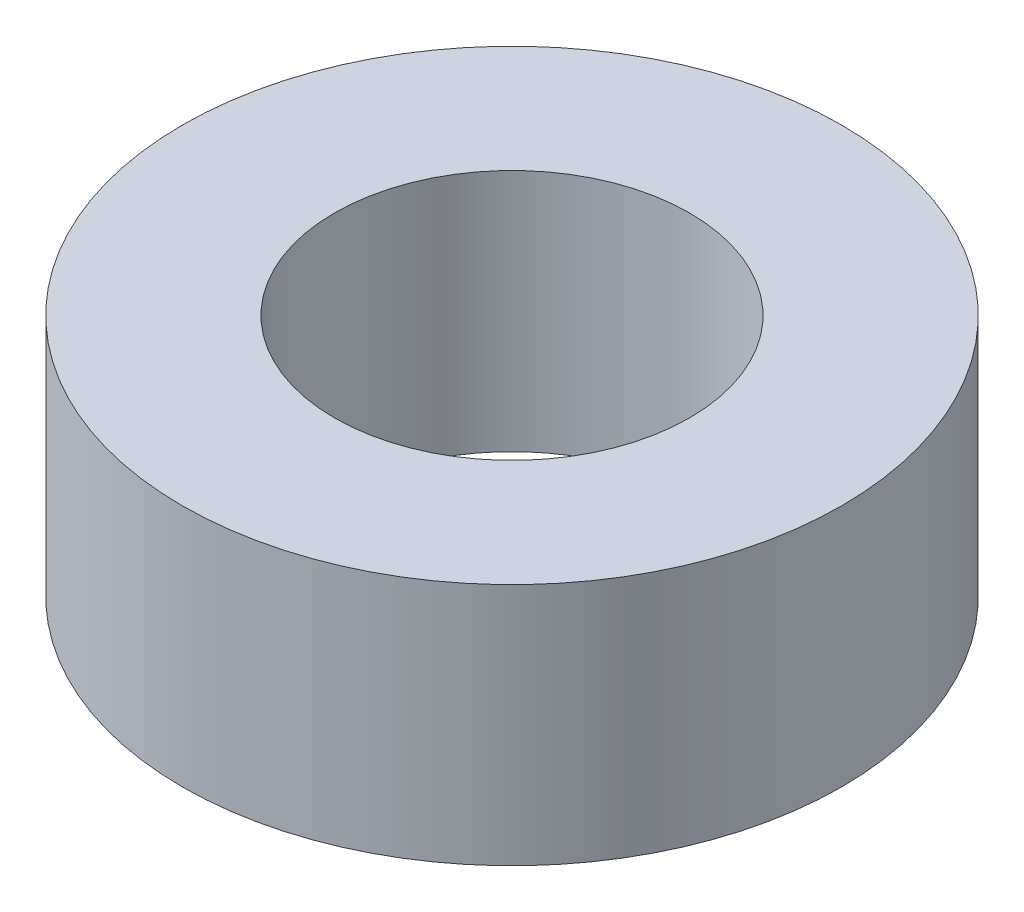
ISO-10303-21;
HEADER;
FILE_DESCRIPTION(('STEP AP214'),'2;1');
FILE_NAME('part.step','',(''),(''),'','','');
FILE_SCHEMA(('AUTOMOTIVE_DESIGN { 1 0 10303 214 1 1 1 1 }'));
ENDSEC;
DATA;
#1=APPLICATION_CONTEXT('core data for automotive mechanical design processes');
#2=APPLICATION_PROTOCOL_DEFINITION('international standard','automotive_design',2000,#1);
#3=PRODUCT_CONTEXT('',#1,'mechanical');
#4=PRODUCT('Part','Part','',(#3));
#5=PRODUCT_RELATED_PRODUCT_CATEGORY('part','',(#4));
#6=PRODUCT_DEFINITION_FORMATION('','',#4);
#7=PRODUCT_DEFINITION_CONTEXT('part definition',#1,'design');
#8=PRODUCT_DEFINITION('design','',#6,#7);
#9=PRODUCT_DEFINITION_SHAPE('','',#8);
#10=(LENGTH_UNIT() NAMED_UNIT(*) SI_UNIT(.MILLI.,.METRE.));
#11=(NAMED_UNIT(*) PLANE_ANGLE_UNIT() SI_UNIT($,.RADIAN.));
#12=(NAMED_UNIT(*) SI_UNIT($,.STERADIAN.) SOLID_ANGLE_UNIT());
#13=UNCERTAINTY_MEASURE_WITH_UNIT(LENGTH_MEASURE(1.E-05),#10,'distance_accuracy_value','');
#14=(GEOMETRIC_REPRESENTATION_CONTEXT(3) GLOBAL_UNCERTAINTY_ASSIGNED_CONTEXT((#13)) GLOBAL_UNIT_ASSIGNED_CONTEXT((#10,
#11,#12)) REPRESENTATION_CONTEXT('',''));
#15=CARTESIAN_POINT('',(0.,0.,0.));
#16=DIRECTION('',(0.,0.,1.));
#17=DIRECTION('',(1.,0.,0.));
#18=AXIS2_PLACEMENT_3D('',#15,#16,#17);
#19=CARTESIAN_POINT('',(0.,24.,0.));
#20=DIRECTION('',(0.,-1.,0.));
#21=DIRECTION('',(0.,0.,-1.));
#22=AXIS2_PLACEMENT_3D('',#19,#20,#21);
#23=CYLINDRICAL_SURFACE('',#22,32.5);
#24=CARTESIAN_POINT('',(0.,24.,0.));
#25=DIRECTION('',(0.,1.,0.));
#26=DIRECTION('',(0.,0.,1.));
#27=AXIS2_PLACEMENT_3D('',#24,#25,#26);
#28=CIRCLE('',#27,32.5);
#29=CARTESIAN_POINT('',(0.,24.,32.5));
#30=VERTEX_POINT('',#29);
#31=EDGE_CURVE('E10',#30,#30,#28,.T.);
#32=ORIENTED_EDGE('',*,*,#31,.F.);
#33=EDGE_LOOP('',(#32));
#34=FACE_BOUND('',#33,.T.);
#35=CARTESIAN_POINT('',(0.,0.,0.));
#36=DIRECTION('',(0.,1.,0.));
#37=DIRECTION('',(0.,0.,1.));
#38=AXIS2_PLACEMENT_3D('',#35,#36,#37);
#39=CIRCLE('',#38,32.5);
#40=CARTESIAN_POINT('',(0.,0.,32.5));
#41=VERTEX_POINT('',#40);
#42=EDGE_CURVE('E37',#41,#41,#39,.T.);
#43=ORIENTED_EDGE('',*,*,#42,.T.);
#44=EDGE_LOOP('',(#43));
#45=FACE_BOUND('',#44,.T.);
#46=ADVANCED_FACE('F40',(#34,#45),#23,.T.);
#47=CARTESIAN_POINT('',(0.,24.,0.));
#48=DIRECTION('',(0.,1.,0.));
#49=DIRECTION('',(0.,0.,1.));
#50=AXIS2_PLACEMENT_3D('',#47,#48,#49);
#51=PLANE('',#50);
#52=CARTESIAN_POINT('',(0.,24.,0.));
#53=DIRECTION('',(0.,1.,0.));
#54=DIRECTION('',(0.,0.,1.));
#55=AXIS2_PLACEMENT_3D('',#52,#53,#54);
#56=CIRCLE('',#55,17.5);
#57=CARTESIAN_POINT('',(0.,24.,17.5));
#58=VERTEX_POINT('',#57);
#59=EDGE_CURVE('E50',#58,#58,#56,.T.);
#60=ORIENTED_EDGE('',*,*,#59,.F.);
#61=EDGE_LOOP('',(#60));
#62=FACE_BOUND('',#61,.T.);
#63=ORIENTED_EDGE('',*,*,#31,.T.);
#64=EDGE_LOOP('',(#63));
#65=FACE_BOUND('',#64,.T.);
#66=ADVANCED_FACE('F59',(#62,#65),#51,.T.);
#67=CARTESIAN_POINT('',(0.,0.,0.));
#68=DIRECTION('',(0.,1.,0.));
#69=DIRECTION('',(0.,0.,1.));
#70=AXIS2_PLACEMENT_3D('',#67,#68,#69);
#71=PLANE('',#70);
#72=CARTESIAN_POINT('',(0.,0.,0.));
#73=DIRECTION('',(0.,1.,0.));
#74=DIRECTION('',(0.,0.,1.));
#75=AXIS2_PLACEMENT_3D('',#72,#73,#74);
#76=CIRCLE('',#75,17.5);
#77=CARTESIAN_POINT('',(0.,0.,17.5));
#78=VERTEX_POINT('',#77);
#79=EDGE_CURVE('E47',#78,#78,#76,.T.);
#80=ORIENTED_EDGE('',*,*,#79,.T.);
#81=EDGE_LOOP('',(#80));
#82=FACE_BOUND('',#81,.T.);
#83=ORIENTED_EDGE('',*,*,#42,.F.);
#84=EDGE_LOOP('',(#83));
#85=FACE_BOUND('',#84,.T.);
#86=ADVANCED_FACE('F58',(#82,#85),#71,.F.);
#87=CARTESIAN_POINT('',(0.,24.,0.));
#88=DIRECTION('',(0.,-1.,0.));
#89=DIRECTION('',(0.,0.,-1.));
#90=AXIS2_PLACEMENT_3D('',#87,#88,#89);
#91=CYLINDRICAL_SURFACE('',#90,17.5);
#92=ORIENTED_EDGE('',*,*,#59,.T.);
#93=EDGE_LOOP('',(#92));
#94=FACE_BOUND('',#93,.T.);
#95=ORIENTED_EDGE('',*,*,#79,.F.);
#96=EDGE_LOOP('',(#95));
#97=FACE_BOUND('',#96,.T.);
#98=ADVANCED_FACE('F54',(#94,#97),#91,.F.);
#99=CLOSED_SHELL('',(#46,#66,#86,#98));
#100=MANIFOLD_SOLID_BREP('B2',#99);
#101=ADVANCED_BREP_SHAPE_REPRESENTATION('',(#18,#100),#14);
#102=SHAPE_DEFINITION_REPRESENTATION(#9,#101);
ENDSEC;
END-ISO-10303-21;
